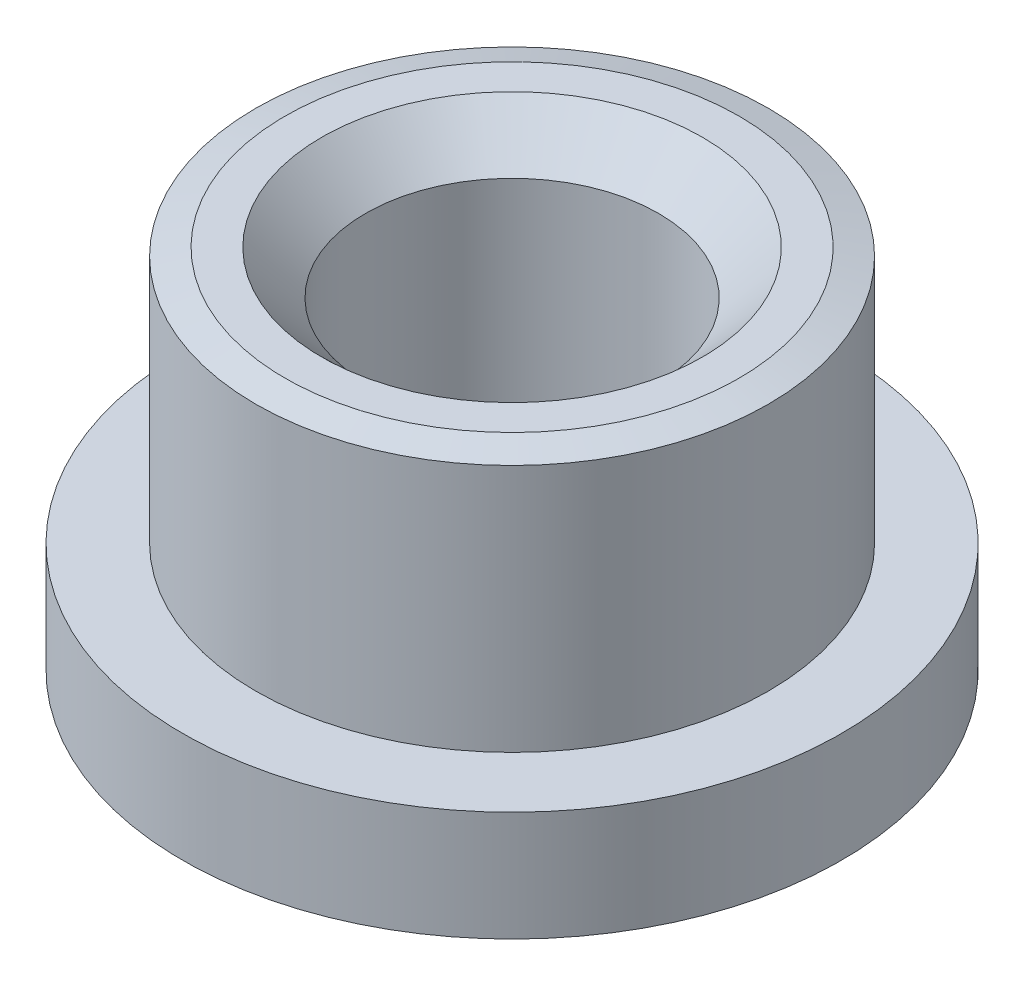
ISO-10303-21;
HEADER;
FILE_DESCRIPTION(('STEP AP214'),'2;1');
FILE_NAME('part.step','',(''),(''),'','','');
FILE_SCHEMA(('AUTOMOTIVE_DESIGN { 1 0 10303 214 1 1 1 1 }'));
ENDSEC;
DATA;
#1=APPLICATION_CONTEXT('core data for automotive mechanical design processes');
#2=APPLICATION_PROTOCOL_DEFINITION('international standard','automotive_design',2000,#1);
#3=PRODUCT_CONTEXT('',#1,'mechanical');
#4=PRODUCT('Part','Part','',(#3));
#5=PRODUCT_RELATED_PRODUCT_CATEGORY('part','',(#4));
#6=PRODUCT_DEFINITION_FORMATION('','',#4);
#7=PRODUCT_DEFINITION_CONTEXT('part definition',#1,'design');
#8=PRODUCT_DEFINITION('design','',#6,#7);
#9=PRODUCT_DEFINITION_SHAPE('','',#8);
#10=(LENGTH_UNIT() NAMED_UNIT(*) SI_UNIT(.MILLI.,.METRE.));
#11=(NAMED_UNIT(*) PLANE_ANGLE_UNIT() SI_UNIT($,.RADIAN.));
#12=(NAMED_UNIT(*) SI_UNIT($,.STERADIAN.) SOLID_ANGLE_UNIT());
#13=UNCERTAINTY_MEASURE_WITH_UNIT(LENGTH_MEASURE(1.E-05),#10,'distance_accuracy_value','');
#14=(GEOMETRIC_REPRESENTATION_CONTEXT(3) GLOBAL_UNCERTAINTY_ASSIGNED_CONTEXT((#13)) GLOBAL_UNIT_ASSIGNED_CONTEXT((#10,
#11,#12)) REPRESENTATION_CONTEXT('',''));
#15=CARTESIAN_POINT('',(0.,0.,0.));
#16=DIRECTION('',(0.,0.,1.));
#17=DIRECTION('',(1.,0.,0.));
#18=AXIS2_PLACEMENT_3D('',#15,#16,#17);
#19=CARTESIAN_POINT('',(0.,-11.687612647578,0.));
#20=DIRECTION('',(0.,-1.,0.));
#21=DIRECTION('',(0.,0.,-1.));
#22=AXIS2_PLACEMENT_3D('',#19,#20,#21);
#23=CYLINDRICAL_SURFACE('',#22,4.);
#24=CARTESIAN_POINT('',(0.,8.8,0.));
#25=DIRECTION('',(0.,-1.,0.));
#26=DIRECTION('',(0.,0.,-1.));
#27=AXIS2_PLACEMENT_3D('',#24,#25,#26);
#28=CIRCLE('',#27,4.);
#29=CARTESIAN_POINT('',(0.,8.8,-4.));
#30=VERTEX_POINT('',#29);
#31=EDGE_CURVE('E10',#30,#30,#28,.F.);
#32=ORIENTED_EDGE('',*,*,#31,.T.);
#33=EDGE_LOOP('',(#32));
#34=FACE_BOUND('',#33,.T.);
#35=CARTESIAN_POINT('',(0.,0.,0.));
#36=DIRECTION('',(0.,-1.,0.));
#37=DIRECTION('',(0.,0.,-1.));
#38=AXIS2_PLACEMENT_3D('',#35,#36,#37);
#39=CIRCLE('',#38,4.);
#40=CARTESIAN_POINT('',(0.,0.,-4.));
#41=VERTEX_POINT('',#40);
#42=EDGE_CURVE('E53',#41,#41,#39,.T.);
#43=ORIENTED_EDGE('',*,*,#42,.T.);
#44=EDGE_LOOP('',(#43));
#45=FACE_BOUND('',#44,.T.);
#46=ADVANCED_FACE('F32',(#34,#45),#23,.F.);
#47=CARTESIAN_POINT('',(-4.,0.,0.));
#48=DIRECTION('',(0.,1.,0.));
#49=DIRECTION('',(0.,0.,1.));
#50=AXIS2_PLACEMENT_3D('',#47,#48,#49);
#51=PLANE('',#50);
#52=ORIENTED_EDGE('',*,*,#42,.F.);
#53=EDGE_LOOP('',(#52));
#54=FACE_BOUND('',#53,.T.);
#55=CARTESIAN_POINT('',(0.,0.,0.));
#56=DIRECTION('',(0.,-1.,0.));
#57=DIRECTION('',(0.,0.,-1.));
#58=AXIS2_PLACEMENT_3D('',#55,#56,#57);
#59=CIRCLE('',#58,9.);
#60=CARTESIAN_POINT('',(0.,0.,-9.));
#61=VERTEX_POINT('',#60);
#62=EDGE_CURVE('E56',#61,#61,#59,.T.);
#63=ORIENTED_EDGE('',*,*,#62,.T.);
#64=EDGE_LOOP('',(#63));
#65=FACE_BOUND('',#64,.T.);
#66=ADVANCED_FACE('F83',(#54,#65),#51,.F.);
#67=CARTESIAN_POINT('',(0.,-11.687612647578,0.));
#68=DIRECTION('',(0.,-1.,0.));
#69=DIRECTION('',(0.,0.,-1.));
#70=AXIS2_PLACEMENT_3D('',#67,#68,#69);
#71=CYLINDRICAL_SURFACE('',#70,9.);
#72=ORIENTED_EDGE('',*,*,#62,.F.);
#73=EDGE_LOOP('',(#72));
#74=FACE_BOUND('',#73,.T.);
#75=CARTESIAN_POINT('',(0.,3.,0.));
#76=DIRECTION('',(0.,-1.,0.));
#77=DIRECTION('',(0.,0.,-1.));
#78=AXIS2_PLACEMENT_3D('',#75,#76,#77);
#79=CIRCLE('',#78,9.);
#80=CARTESIAN_POINT('',(0.,3.,-9.));
#81=VERTEX_POINT('',#80);
#82=EDGE_CURVE('E59',#81,#81,#79,.T.);
#83=ORIENTED_EDGE('',*,*,#82,.T.);
#84=EDGE_LOOP('',(#83));
#85=FACE_BOUND('',#84,.T.);
#86=ADVANCED_FACE('F79',(#74,#85),#71,.T.);
#87=CARTESIAN_POINT('',(-9.,3.,0.));
#88=DIRECTION('',(0.,-1.,0.));
#89=DIRECTION('',(0.,0.,-1.));
#90=AXIS2_PLACEMENT_3D('',#87,#88,#89);
#91=PLANE('',#90);
#92=ORIENTED_EDGE('',*,*,#82,.F.);
#93=EDGE_LOOP('',(#92));
#94=FACE_BOUND('',#93,.T.);
#95=CARTESIAN_POINT('',(0.,3.,0.));
#96=DIRECTION('',(0.,-1.,0.));
#97=DIRECTION('',(0.,0.,-1.));
#98=AXIS2_PLACEMENT_3D('',#95,#96,#97);
#99=CIRCLE('',#98,7.);
#100=CARTESIAN_POINT('',(0.,3.,-7.));
#101=VERTEX_POINT('',#100);
#102=EDGE_CURVE('E62',#101,#101,#99,.T.);
#103=ORIENTED_EDGE('',*,*,#102,.T.);
#104=EDGE_LOOP('',(#103));
#105=FACE_BOUND('',#104,.T.);
#106=ADVANCED_FACE('F66',(#94,#105),#91,.F.);
#107=CARTESIAN_POINT('',(0.,-11.687612647578,0.));
#108=DIRECTION('',(0.,-1.,0.));
#109=DIRECTION('',(0.,0.,-1.));
#110=AXIS2_PLACEMENT_3D('',#107,#108,#109);
#111=CYLINDRICAL_SURFACE('',#110,7.);
#112=CARTESIAN_POINT('',(0.,9.7856406460551,0.));
#113=DIRECTION('',(0.,-1.,0.));
#114=DIRECTION('',(0.,0.,-1.));
#115=AXIS2_PLACEMENT_3D('',#112,#113,#114);
#116=CIRCLE('',#115,7.);
#117=CARTESIAN_POINT('',(0.,9.7856406460551,-7.));
#118=VERTEX_POINT('',#117);
#119=EDGE_CURVE('E48',#118,#118,#116,.T.);
#120=ORIENTED_EDGE('',*,*,#119,.T.);
#121=EDGE_LOOP('',(#120));
#122=FACE_BOUND('',#121,.T.);
#123=ORIENTED_EDGE('',*,*,#102,.F.);
#124=EDGE_LOOP('',(#123));
#125=FACE_BOUND('',#124,.T.);
#126=ADVANCED_FACE('F68',(#122,#125),#111,.T.);
#127=CARTESIAN_POINT('',(-7.,10.,0.));
#128=DIRECTION('',(0.,-1.,0.));
#129=DIRECTION('',(0.,0.,-1.));
#130=AXIS2_PLACEMENT_3D('',#127,#128,#129);
#131=PLANE('',#130);
#132=CARTESIAN_POINT('',(0.,10.,0.));
#133=DIRECTION('',(0.,-1.,0.));
#134=DIRECTION('',(0.,0.,-1.));
#135=AXIS2_PLACEMENT_3D('',#132,#133,#134);
#136=CIRCLE('',#135,5.2);
#137=CARTESIAN_POINT('',(0.,10.,-5.2));
#138=VERTEX_POINT('',#137);
#139=EDGE_CURVE('E40',#138,#138,#136,.T.);
#140=ORIENTED_EDGE('',*,*,#139,.T.);
#141=EDGE_LOOP('',(#140));
#142=FACE_BOUND('',#141,.T.);
#143=CARTESIAN_POINT('',(0.,10.,0.));
#144=DIRECTION('',(0.,-1.,0.));
#145=DIRECTION('',(0.,0.,-1.));
#146=AXIS2_PLACEMENT_3D('',#143,#144,#145);
#147=CIRCLE('',#146,6.2);
#148=CARTESIAN_POINT('',(0.,10.,-6.2));
#149=VERTEX_POINT('',#148);
#150=EDGE_CURVE('E44',#149,#149,#147,.F.);
#151=ORIENTED_EDGE('',*,*,#150,.T.);
#152=EDGE_LOOP('',(#151));
#153=FACE_BOUND('',#152,.T.);
#154=ADVANCED_FACE('F70',(#142,#153),#131,.F.);
#155=CARTESIAN_POINT('',(0.,9.7856406460551,0.));
#156=DIRECTION('',(0.,-1.,0.));
#157=DIRECTION('',(0.,0.,-1.));
#158=AXIS2_PLACEMENT_3D('',#155,#156,#157);
#159=CONICAL_SURFACE('',#158,7.,1.30899693899575);
#160=ORIENTED_EDGE('',*,*,#150,.F.);
#161=EDGE_LOOP('',(#160));
#162=FACE_BOUND('',#161,.T.);
#163=ORIENTED_EDGE('',*,*,#119,.F.);
#164=EDGE_LOOP('',(#163));
#165=FACE_BOUND('',#164,.T.);
#166=ADVANCED_FACE('F77',(#162,#165),#159,.T.);
#167=CARTESIAN_POINT('',(0.,10.,0.));
#168=DIRECTION('',(0.,1.,0.));
#169=DIRECTION('',(0.,0.,1.));
#170=AXIS2_PLACEMENT_3D('',#167,#168,#169);
#171=CONICAL_SURFACE('',#170,5.2,0.785398163397447);
#172=ORIENTED_EDGE('',*,*,#31,.F.);
#173=EDGE_LOOP('',(#172));
#174=FACE_BOUND('',#173,.T.);
#175=ORIENTED_EDGE('',*,*,#139,.F.);
#176=EDGE_LOOP('',(#175));
#177=FACE_BOUND('',#176,.T.);
#178=ADVANCED_FACE('F35',(#174,#177),#171,.F.);
#179=CLOSED_SHELL('',(#46,#66,#86,#106,#126,#154,#166,#178));
#180=MANIFOLD_SOLID_BREP('B2',#179);
#181=ADVANCED_BREP_SHAPE_REPRESENTATION('',(#18,#180),#14);
#182=SHAPE_DEFINITION_REPRESENTATION(#9,#181);
ENDSEC;
END-ISO-10303-21;
